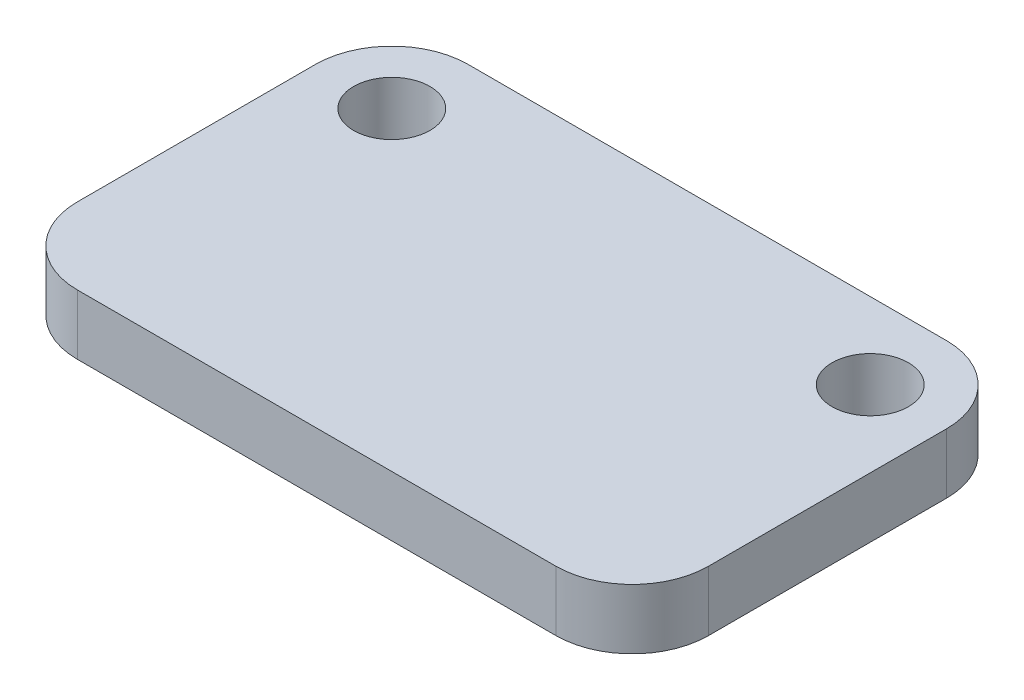
ISO-10303-21;
HEADER;
FILE_DESCRIPTION(('STEP AP214'),'2;1');
FILE_NAME('part.step','',(''),(''),'','','');
FILE_SCHEMA(('AUTOMOTIVE_DESIGN { 1 0 10303 214 1 1 1 1 }'));
ENDSEC;
DATA;
#1=APPLICATION_CONTEXT('core data for automotive mechanical design processes');
#2=APPLICATION_PROTOCOL_DEFINITION('international standard','automotive_design',2000,#1);
#3=PRODUCT_CONTEXT('',#1,'mechanical');
#4=PRODUCT('Part','Part','',(#3));
#5=PRODUCT_RELATED_PRODUCT_CATEGORY('part','',(#4));
#6=PRODUCT_DEFINITION_FORMATION('','',#4);
#7=PRODUCT_DEFINITION_CONTEXT('part definition',#1,'design');
#8=PRODUCT_DEFINITION('design','',#6,#7);
#9=PRODUCT_DEFINITION_SHAPE('','',#8);
#10=(LENGTH_UNIT() NAMED_UNIT(*) SI_UNIT(.MILLI.,.METRE.));
#11=(NAMED_UNIT(*) PLANE_ANGLE_UNIT() SI_UNIT($,.RADIAN.));
#12=(NAMED_UNIT(*) SI_UNIT($,.STERADIAN.) SOLID_ANGLE_UNIT());
#13=UNCERTAINTY_MEASURE_WITH_UNIT(LENGTH_MEASURE(1.E-05),#10,'distance_accuracy_value','');
#14=(GEOMETRIC_REPRESENTATION_CONTEXT(3) GLOBAL_UNCERTAINTY_ASSIGNED_CONTEXT((#13)) GLOBAL_UNIT_ASSIGNED_CONTEXT((#10,
#11,#12)) REPRESENTATION_CONTEXT('',''));
#15=CARTESIAN_POINT('',(0.,0.,0.));
#16=DIRECTION('',(0.,0.,1.));
#17=DIRECTION('',(1.,0.,0.));
#18=AXIS2_PLACEMENT_3D('',#15,#16,#17);
#19=CARTESIAN_POINT('',(0.,2.,0.));
#20=DIRECTION('',(1.,0.,0.));
#21=DIRECTION('',(0.,0.,-1.));
#22=AXIS2_PLACEMENT_3D('',#19,#20,#21);
#23=PLANE('',#22);
#24=DIRECTION('',(0.,0.,1.));
#25=VECTOR('',#24,1.);
#26=CARTESIAN_POINT('',(0.,0.,0.));
#27=LINE('',#26,#25);
#28=CARTESIAN_POINT('',(0.,0.,-10.46));
#29=VERTEX_POINT('',#28);
#30=CARTESIAN_POINT('',(0.,0.,-2.54));
#31=VERTEX_POINT('',#30);
#32=EDGE_CURVE('E182',#29,#31,#27,.T.);
#33=ORIENTED_EDGE('',*,*,#32,.T.);
#34=DIRECTION('',(0.,-1.,0.));
#35=VECTOR('',#34,1.);
#36=CARTESIAN_POINT('',(0.,2.,-2.54));
#37=LINE('',#36,#35);
#38=CARTESIAN_POINT('',(0.,2.,-2.54));
#39=VERTEX_POINT('',#38);
#40=EDGE_CURVE('E11',#31,#39,#37,.F.);
#41=ORIENTED_EDGE('',*,*,#40,.T.);
#42=DIRECTION('',(0.,0.,1.));
#43=VECTOR('',#42,1.);
#44=CARTESIAN_POINT('',(0.,2.,0.));
#45=LINE('',#44,#43);
#46=CARTESIAN_POINT('',(0.,2.,-10.46));
#47=VERTEX_POINT('',#46);
#48=EDGE_CURVE('E135',#47,#39,#45,.T.);
#49=ORIENTED_EDGE('',*,*,#48,.F.);
#50=DIRECTION('',(0.,-1.,0.));
#51=VECTOR('',#50,1.);
#52=CARTESIAN_POINT('',(0.,2.,-10.46));
#53=LINE('',#52,#51);
#54=EDGE_CURVE('E48',#47,#29,#53,.T.);
#55=ORIENTED_EDGE('',*,*,#54,.T.);
#56=EDGE_LOOP('',(#33,#41,#49,#55));
#57=FACE_BOUND('',#56,.T.);
#58=ADVANCED_FACE('F39',(#57),#23,.F.);
#59=CARTESIAN_POINT('',(0.,2.,0.));
#60=DIRECTION('',(0.,0.,-1.));
#61=DIRECTION('',(-1.,0.,0.));
#62=AXIS2_PLACEMENT_3D('',#59,#60,#61);
#63=PLANE('',#62);
#64=DIRECTION('',(1.,0.,0.));
#65=VECTOR('',#64,1.);
#66=CARTESIAN_POINT('',(0.,0.,0.));
#67=LINE('',#66,#65);
#68=CARTESIAN_POINT('',(2.54,0.,0.));
#69=VERTEX_POINT('',#68);
#70=CARTESIAN_POINT('',(18.46,0.,0.));
#71=VERTEX_POINT('',#70);
#72=EDGE_CURVE('E142',#69,#71,#67,.T.);
#73=ORIENTED_EDGE('',*,*,#72,.T.);
#74=DIRECTION('',(0.,-1.,0.));
#75=VECTOR('',#74,1.);
#76=CARTESIAN_POINT('',(18.46,2.,0.));
#77=LINE('',#76,#75);
#78=CARTESIAN_POINT('',(18.46,2.,0.));
#79=VERTEX_POINT('',#78);
#80=EDGE_CURVE('E55',#71,#79,#77,.F.);
#81=ORIENTED_EDGE('',*,*,#80,.T.);
#82=DIRECTION('',(1.,0.,0.));
#83=VECTOR('',#82,1.);
#84=CARTESIAN_POINT('',(0.,2.,0.));
#85=LINE('',#84,#83);
#86=CARTESIAN_POINT('',(2.54,2.,0.));
#87=VERTEX_POINT('',#86);
#88=EDGE_CURVE('E140',#87,#79,#85,.T.);
#89=ORIENTED_EDGE('',*,*,#88,.F.);
#90=DIRECTION('',(0.,-1.,0.));
#91=VECTOR('',#90,1.);
#92=CARTESIAN_POINT('',(2.54,2.,0.));
#93=LINE('',#92,#91);
#94=EDGE_CURVE('E171',#87,#69,#93,.T.);
#95=ORIENTED_EDGE('',*,*,#94,.T.);
#96=EDGE_LOOP('',(#73,#81,#89,#95));
#97=FACE_BOUND('',#96,.T.);
#98=ADVANCED_FACE('F230',(#97),#63,.F.);
#99=CARTESIAN_POINT('',(21.,2.,0.));
#100=DIRECTION('',(-1.,0.,0.));
#101=DIRECTION('',(0.,0.,1.));
#102=AXIS2_PLACEMENT_3D('',#99,#100,#101);
#103=PLANE('',#102);
#104=DIRECTION('',(0.,0.,-1.));
#105=VECTOR('',#104,1.);
#106=CARTESIAN_POINT('',(21.,0.,0.));
#107=LINE('',#106,#105);
#108=CARTESIAN_POINT('',(21.,0.,-2.54));
#109=VERTEX_POINT('',#108);
#110=CARTESIAN_POINT('',(21.,0.,-10.46));
#111=VERTEX_POINT('',#110);
#112=EDGE_CURVE('E136',#109,#111,#107,.T.);
#113=ORIENTED_EDGE('',*,*,#112,.T.);
#114=DIRECTION('',(0.,-1.,0.));
#115=VECTOR('',#114,1.);
#116=CARTESIAN_POINT('',(21.,2.,-10.46));
#117=LINE('',#116,#115);
#118=CARTESIAN_POINT('',(21.,2.,-10.46));
#119=VERTEX_POINT('',#118);
#120=EDGE_CURVE('E111',#111,#119,#117,.F.);
#121=ORIENTED_EDGE('',*,*,#120,.T.);
#122=DIRECTION('',(0.,0.,-1.));
#123=VECTOR('',#122,1.);
#124=CARTESIAN_POINT('',(21.,2.,0.));
#125=LINE('',#124,#123);
#126=CARTESIAN_POINT('',(21.,2.,-2.54));
#127=VERTEX_POINT('',#126);
#128=EDGE_CURVE('E198',#127,#119,#125,.T.);
#129=ORIENTED_EDGE('',*,*,#128,.F.);
#130=DIRECTION('',(0.,-1.,0.));
#131=VECTOR('',#130,1.);
#132=CARTESIAN_POINT('',(21.,2.,-2.54));
#133=LINE('',#132,#131);
#134=EDGE_CURVE('E117',#127,#109,#133,.T.);
#135=ORIENTED_EDGE('',*,*,#134,.T.);
#136=EDGE_LOOP('',(#113,#121,#129,#135));
#137=FACE_BOUND('',#136,.T.);
#138=ADVANCED_FACE('F227',(#137),#103,.F.);
#139=CARTESIAN_POINT('',(0.,2.,-13.));
#140=DIRECTION('',(0.,0.,1.));
#141=DIRECTION('',(1.,0.,0.));
#142=AXIS2_PLACEMENT_3D('',#139,#140,#141);
#143=PLANE('',#142);
#144=DIRECTION('',(-1.,0.,0.));
#145=VECTOR('',#144,1.);
#146=CARTESIAN_POINT('',(0.,2.,-13.));
#147=LINE('',#146,#145);
#148=CARTESIAN_POINT('',(18.46,2.,-13.));
#149=VERTEX_POINT('',#148);
#150=CARTESIAN_POINT('',(2.54,2.,-13.));
#151=VERTEX_POINT('',#150);
#152=EDGE_CURVE('E127',#149,#151,#147,.T.);
#153=ORIENTED_EDGE('',*,*,#152,.F.);
#154=DIRECTION('',(0.,-1.,0.));
#155=VECTOR('',#154,1.);
#156=CARTESIAN_POINT('',(18.46,2.,-13.));
#157=LINE('',#156,#155);
#158=CARTESIAN_POINT('',(18.46,0.,-13.));
#159=VERTEX_POINT('',#158);
#160=EDGE_CURVE('E110',#149,#159,#157,.T.);
#161=ORIENTED_EDGE('',*,*,#160,.T.);
#162=DIRECTION('',(-1.,0.,0.));
#163=VECTOR('',#162,1.);
#164=CARTESIAN_POINT('',(0.,0.,-13.));
#165=LINE('',#164,#163);
#166=CARTESIAN_POINT('',(2.54,0.,-13.));
#167=VERTEX_POINT('',#166);
#168=EDGE_CURVE('E124',#159,#167,#165,.T.);
#169=ORIENTED_EDGE('',*,*,#168,.T.);
#170=DIRECTION('',(0.,-1.,0.));
#171=VECTOR('',#170,1.);
#172=CARTESIAN_POINT('',(2.54,2.,-13.));
#173=LINE('',#172,#171);
#174=EDGE_CURVE('E130',#167,#151,#173,.F.);
#175=ORIENTED_EDGE('',*,*,#174,.T.);
#176=EDGE_LOOP('',(#153,#161,#169,#175));
#177=FACE_BOUND('',#176,.T.);
#178=ADVANCED_FACE('F123',(#177),#143,.F.);
#179=CARTESIAN_POINT('',(0.,2.,0.));
#180=DIRECTION('',(0.,-1.,0.));
#181=DIRECTION('',(0.,0.,-1.));
#182=AXIS2_PLACEMENT_3D('',#179,#180,#181);
#183=PLANE('',#182);
#184=CARTESIAN_POINT('',(2.54,2.,-10.46));
#185=DIRECTION('',(0.,1.,0.));
#186=DIRECTION('',(0.,0.,1.));
#187=AXIS2_PLACEMENT_3D('',#184,#185,#186);
#188=CIRCLE('',#187,1.27);
#189=CARTESIAN_POINT('',(2.54,2.,-9.19));
#190=VERTEX_POINT('',#189);
#191=EDGE_CURVE('E193',#190,#190,#188,.T.);
#192=ORIENTED_EDGE('',*,*,#191,.F.);
#193=EDGE_LOOP('',(#192));
#194=FACE_BOUND('',#193,.T.);
#195=CARTESIAN_POINT('',(18.46,2.,-10.46));
#196=DIRECTION('',(0.,1.,0.));
#197=DIRECTION('',(0.,0.,-1.));
#198=AXIS2_PLACEMENT_3D('',#195,#196,#197);
#199=CIRCLE('',#198,1.27);
#200=CARTESIAN_POINT('',(18.46,2.,-11.73));
#201=VERTEX_POINT('',#200);
#202=EDGE_CURVE('E204',#201,#201,#199,.T.);
#203=ORIENTED_EDGE('',*,*,#202,.F.);
#204=EDGE_LOOP('',(#203));
#205=FACE_BOUND('',#204,.T.);
#206=ORIENTED_EDGE('',*,*,#128,.T.);
#207=CARTESIAN_POINT('',(18.46,2.,-10.46));
#208=DIRECTION('',(0.,-1.,0.));
#209=DIRECTION('',(0.,0.,-1.));
#210=AXIS2_PLACEMENT_3D('',#207,#208,#209);
#211=CIRCLE('',#210,2.54);
#212=EDGE_CURVE('E168',#119,#149,#211,.F.);
#213=ORIENTED_EDGE('',*,*,#212,.T.);
#214=ORIENTED_EDGE('',*,*,#152,.T.);
#215=CARTESIAN_POINT('',(2.54,2.,-10.46));
#216=DIRECTION('',(0.,-1.,0.));
#217=DIRECTION('',(0.,0.,-1.));
#218=AXIS2_PLACEMENT_3D('',#215,#216,#217);
#219=CIRCLE('',#218,2.54);
#220=EDGE_CURVE('E160',#151,#47,#219,.F.);
#221=ORIENTED_EDGE('',*,*,#220,.T.);
#222=ORIENTED_EDGE('',*,*,#48,.T.);
#223=CARTESIAN_POINT('',(2.54,2.,-2.54));
#224=DIRECTION('',(0.,-1.,0.));
#225=DIRECTION('',(0.,0.,-1.));
#226=AXIS2_PLACEMENT_3D('',#223,#224,#225);
#227=CIRCLE('',#226,2.54);
#228=EDGE_CURVE('E62',#39,#87,#227,.F.);
#229=ORIENTED_EDGE('',*,*,#228,.T.);
#230=ORIENTED_EDGE('',*,*,#88,.T.);
#231=CARTESIAN_POINT('',(18.46,2.,-2.54));
#232=DIRECTION('',(0.,-1.,0.));
#233=DIRECTION('',(0.,0.,-1.));
#234=AXIS2_PLACEMENT_3D('',#231,#232,#233);
#235=CIRCLE('',#234,2.54);
#236=EDGE_CURVE('E165',#79,#127,#235,.F.);
#237=ORIENTED_EDGE('',*,*,#236,.T.);
#238=EDGE_LOOP('',(#206,#213,#214,#221,#222,#229,#230,#237));
#239=FACE_BOUND('',#238,.T.);
#240=ADVANCED_FACE('F218',(#194,#205,#239),#183,.F.);
#241=CARTESIAN_POINT('',(0.,0.,0.));
#242=DIRECTION('',(0.,-1.,0.));
#243=DIRECTION('',(0.,0.,-1.));
#244=AXIS2_PLACEMENT_3D('',#241,#242,#243);
#245=PLANE('',#244);
#246=CARTESIAN_POINT('',(2.54,0.,-10.46));
#247=DIRECTION('',(0.,1.,0.));
#248=DIRECTION('',(0.,0.,1.));
#249=AXIS2_PLACEMENT_3D('',#246,#247,#248);
#250=CIRCLE('',#249,1.27);
#251=CARTESIAN_POINT('',(2.54,0.,-9.19));
#252=VERTEX_POINT('',#251);
#253=EDGE_CURVE('E188',#252,#252,#250,.T.);
#254=ORIENTED_EDGE('',*,*,#253,.T.);
#255=EDGE_LOOP('',(#254));
#256=FACE_BOUND('',#255,.T.);
#257=CARTESIAN_POINT('',(18.46,0.,-10.46));
#258=DIRECTION('',(0.,1.,0.));
#259=DIRECTION('',(0.,0.,-1.));
#260=AXIS2_PLACEMENT_3D('',#257,#258,#259);
#261=CIRCLE('',#260,1.27);
#262=CARTESIAN_POINT('',(18.46,0.,-11.73));
#263=VERTEX_POINT('',#262);
#264=EDGE_CURVE('E208',#263,#263,#261,.T.);
#265=ORIENTED_EDGE('',*,*,#264,.T.);
#266=EDGE_LOOP('',(#265));
#267=FACE_BOUND('',#266,.T.);
#268=ORIENTED_EDGE('',*,*,#168,.F.);
#269=CARTESIAN_POINT('',(18.46,0.,-10.46));
#270=DIRECTION('',(0.,-1.,0.));
#271=DIRECTION('',(0.,0.,-1.));
#272=AXIS2_PLACEMENT_3D('',#269,#270,#271);
#273=CIRCLE('',#272,2.54);
#274=EDGE_CURVE('E106',#159,#111,#273,.T.);
#275=ORIENTED_EDGE('',*,*,#274,.T.);
#276=ORIENTED_EDGE('',*,*,#112,.F.);
#277=CARTESIAN_POINT('',(18.46,0.,-2.54));
#278=DIRECTION('',(0.,-1.,0.));
#279=DIRECTION('',(0.,0.,-1.));
#280=AXIS2_PLACEMENT_3D('',#277,#278,#279);
#281=CIRCLE('',#280,2.54);
#282=EDGE_CURVE('E118',#109,#71,#281,.T.);
#283=ORIENTED_EDGE('',*,*,#282,.T.);
#284=ORIENTED_EDGE('',*,*,#72,.F.);
#285=CARTESIAN_POINT('',(2.54,0.,-2.54));
#286=DIRECTION('',(0.,-1.,0.));
#287=DIRECTION('',(0.,0.,-1.));
#288=AXIS2_PLACEMENT_3D('',#285,#286,#287);
#289=CIRCLE('',#288,2.54);
#290=EDGE_CURVE('E150',#69,#31,#289,.T.);
#291=ORIENTED_EDGE('',*,*,#290,.T.);
#292=ORIENTED_EDGE('',*,*,#32,.F.);
#293=CARTESIAN_POINT('',(2.54,0.,-10.46));
#294=DIRECTION('',(0.,-1.,0.));
#295=DIRECTION('',(0.,0.,-1.));
#296=AXIS2_PLACEMENT_3D('',#293,#294,#295);
#297=CIRCLE('',#296,2.54);
#298=EDGE_CURVE('E129',#29,#167,#297,.T.);
#299=ORIENTED_EDGE('',*,*,#298,.T.);
#300=EDGE_LOOP('',(#268,#275,#276,#283,#284,#291,#292,#299));
#301=FACE_BOUND('',#300,.T.);
#302=ADVANCED_FACE('F132',(#256,#267,#301),#245,.T.);
#303=CARTESIAN_POINT('',(18.46,0.,-10.46));
#304=DIRECTION('',(0.,1.,0.));
#305=DIRECTION('',(0.,0.,1.));
#306=AXIS2_PLACEMENT_3D('',#303,#304,#305);
#307=CYLINDRICAL_SURFACE('',#306,1.27);
#308=ORIENTED_EDGE('',*,*,#264,.F.);
#309=EDGE_LOOP('',(#308));
#310=FACE_BOUND('',#309,.T.);
#311=ORIENTED_EDGE('',*,*,#202,.T.);
#312=EDGE_LOOP('',(#311));
#313=FACE_BOUND('',#312,.T.);
#314=ADVANCED_FACE('F278',(#310,#313),#307,.F.);
#315=CARTESIAN_POINT('',(2.54,0.,-10.46));
#316=DIRECTION('',(0.,1.,0.));
#317=DIRECTION('',(0.,0.,1.));
#318=AXIS2_PLACEMENT_3D('',#315,#316,#317);
#319=CYLINDRICAL_SURFACE('',#318,1.27);
#320=ORIENTED_EDGE('',*,*,#253,.F.);
#321=EDGE_LOOP('',(#320));
#322=FACE_BOUND('',#321,.T.);
#323=ORIENTED_EDGE('',*,*,#191,.T.);
#324=EDGE_LOOP('',(#323));
#325=FACE_BOUND('',#324,.T.);
#326=ADVANCED_FACE('F216',(#322,#325),#319,.F.);
#327=CARTESIAN_POINT('',(18.46,2.,-10.46));
#328=DIRECTION('',(0.,-1.,0.));
#329=DIRECTION('',(0.,0.,-1.));
#330=AXIS2_PLACEMENT_3D('',#327,#328,#329);
#331=CYLINDRICAL_SURFACE('',#330,2.54);
#332=ORIENTED_EDGE('',*,*,#212,.F.);
#333=ORIENTED_EDGE('',*,*,#120,.F.);
#334=ORIENTED_EDGE('',*,*,#274,.F.);
#335=ORIENTED_EDGE('',*,*,#160,.F.);
#336=EDGE_LOOP('',(#332,#333,#334,#335));
#337=FACE_BOUND('',#336,.T.);
#338=ADVANCED_FACE('F109',(#337),#331,.T.);
#339=CARTESIAN_POINT('',(18.46,2.,-2.54));
#340=DIRECTION('',(0.,-1.,0.));
#341=DIRECTION('',(0.,0.,-1.));
#342=AXIS2_PLACEMENT_3D('',#339,#340,#341);
#343=CYLINDRICAL_SURFACE('',#342,2.54);
#344=ORIENTED_EDGE('',*,*,#236,.F.);
#345=ORIENTED_EDGE('',*,*,#80,.F.);
#346=ORIENTED_EDGE('',*,*,#282,.F.);
#347=ORIENTED_EDGE('',*,*,#134,.F.);
#348=EDGE_LOOP('',(#344,#345,#346,#347));
#349=FACE_BOUND('',#348,.T.);
#350=ADVANCED_FACE('F229',(#349),#343,.T.);
#351=CARTESIAN_POINT('',(2.54,2.,-2.54));
#352=DIRECTION('',(0.,-1.,0.));
#353=DIRECTION('',(0.,0.,-1.));
#354=AXIS2_PLACEMENT_3D('',#351,#352,#353);
#355=CYLINDRICAL_SURFACE('',#354,2.54);
#356=ORIENTED_EDGE('',*,*,#228,.F.);
#357=ORIENTED_EDGE('',*,*,#40,.F.);
#358=ORIENTED_EDGE('',*,*,#290,.F.);
#359=ORIENTED_EDGE('',*,*,#94,.F.);
#360=EDGE_LOOP('',(#356,#357,#358,#359));
#361=FACE_BOUND('',#360,.T.);
#362=ADVANCED_FACE('F233',(#361),#355,.T.);
#363=CARTESIAN_POINT('',(2.54,2.,-10.46));
#364=DIRECTION('',(0.,-1.,0.));
#365=DIRECTION('',(0.,0.,-1.));
#366=AXIS2_PLACEMENT_3D('',#363,#364,#365);
#367=CYLINDRICAL_SURFACE('',#366,2.54);
#368=ORIENTED_EDGE('',*,*,#220,.F.);
#369=ORIENTED_EDGE('',*,*,#174,.F.);
#370=ORIENTED_EDGE('',*,*,#298,.F.);
#371=ORIENTED_EDGE('',*,*,#54,.F.);
#372=EDGE_LOOP('',(#368,#369,#370,#371));
#373=FACE_BOUND('',#372,.T.);
#374=ADVANCED_FACE('F41',(#373),#367,.T.);
#375=CLOSED_SHELL('',(#58,#98,#138,#178,#240,#302,#314,#326,#338,#350,#362,#374));
#376=MANIFOLD_SOLID_BREP('B2',#375);
#377=ADVANCED_BREP_SHAPE_REPRESENTATION('',(#18,#376),#14);
#378=SHAPE_DEFINITION_REPRESENTATION(#9,#377);
ENDSEC;
END-ISO-10303-21;
